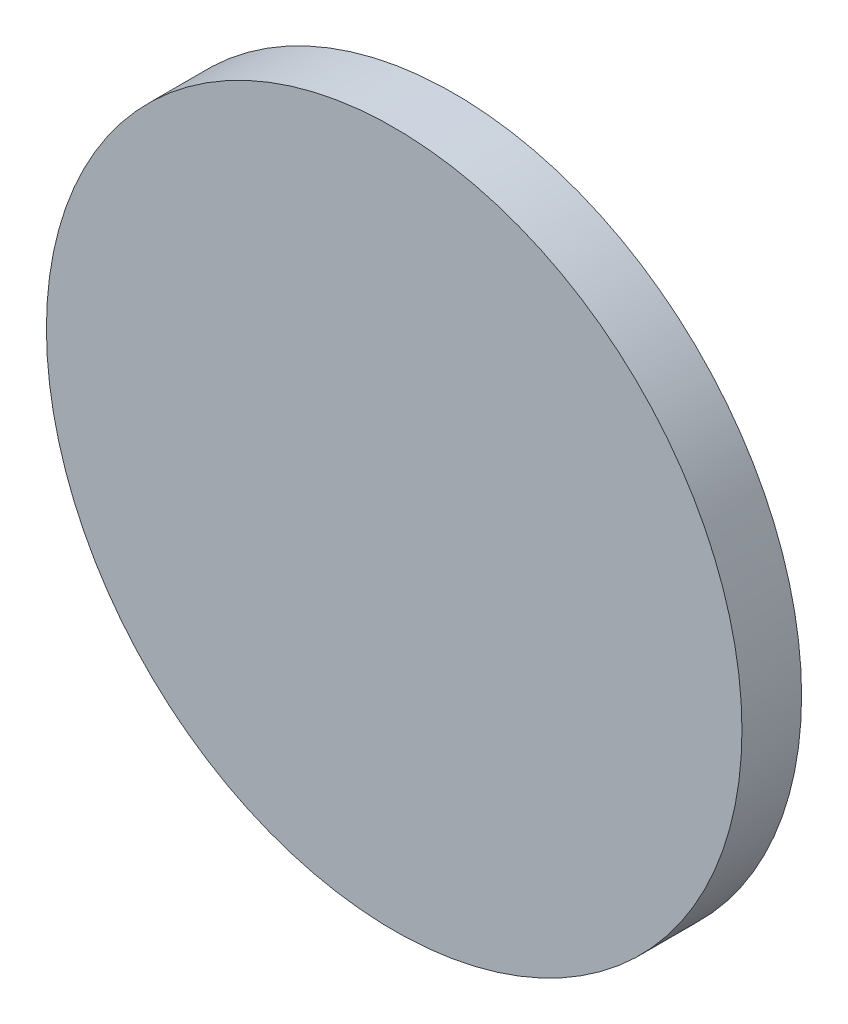
ISO-10303-21;
HEADER;
FILE_DESCRIPTION(('STEP AP214'),'2;1');
FILE_NAME('part.step','',(''),(''),'','','');
FILE_SCHEMA(('AUTOMOTIVE_DESIGN { 1 0 10303 214 1 1 1 1 }'));
ENDSEC;
DATA;
#1=APPLICATION_CONTEXT('core data for automotive mechanical design processes');
#2=APPLICATION_PROTOCOL_DEFINITION('international standard','automotive_design',2000,#1);
#3=PRODUCT_CONTEXT('',#1,'mechanical');
#4=PRODUCT('Part','Part','',(#3));
#5=PRODUCT_RELATED_PRODUCT_CATEGORY('part','',(#4));
#6=PRODUCT_DEFINITION_FORMATION('','',#4);
#7=PRODUCT_DEFINITION_CONTEXT('part definition',#1,'design');
#8=PRODUCT_DEFINITION('design','',#6,#7);
#9=PRODUCT_DEFINITION_SHAPE('','',#8);
#10=(LENGTH_UNIT() NAMED_UNIT(*) SI_UNIT(.MILLI.,.METRE.));
#11=(NAMED_UNIT(*) PLANE_ANGLE_UNIT() SI_UNIT($,.RADIAN.));
#12=(NAMED_UNIT(*) SI_UNIT($,.STERADIAN.) SOLID_ANGLE_UNIT());
#13=UNCERTAINTY_MEASURE_WITH_UNIT(LENGTH_MEASURE(1.E-05),#10,'distance_accuracy_value','');
#14=(GEOMETRIC_REPRESENTATION_CONTEXT(3) GLOBAL_UNCERTAINTY_ASSIGNED_CONTEXT((#13)) GLOBAL_UNIT_ASSIGNED_CONTEXT((#10,
#11,#12)) REPRESENTATION_CONTEXT('',''));
#15=CARTESIAN_POINT('',(0.,0.,0.));
#16=DIRECTION('',(0.,0.,1.));
#17=DIRECTION('',(1.,0.,0.));
#18=AXIS2_PLACEMENT_3D('',#15,#16,#17);
#19=CARTESIAN_POINT('',(9.21766,1.696720014875,0.));
#20=DIRECTION('',(0.,0.,-1.));
#21=DIRECTION('',(-1.,0.,0.));
#22=AXIS2_PLACEMENT_3D('',#19,#20,#21);
#23=PLANE('',#22);
#24=CARTESIAN_POINT('',(9.21766,1.696720014875,0.));
#25=DIRECTION('',(0.,0.,1.));
#26=DIRECTION('',(1.,0.,0.));
#27=AXIS2_PLACEMENT_3D('',#24,#25,#26);
#28=CIRCLE('',#27,0.200024667);
#29=CARTESIAN_POINT('',(9.417684667,1.696720014875,0.));
#30=VERTEX_POINT('',#29);
#31=EDGE_CURVE('E18',#30,#30,#28,.T.);
#32=ORIENTED_EDGE('',*,*,#31,.F.);
#33=EDGE_LOOP('',(#32));
#34=FACE_BOUND('',#33,.T.);
#35=ADVANCED_FACE('F15',(#34),#23,.T.);
#36=CARTESIAN_POINT('',(9.21766,1.696720014875,0.));
#37=DIRECTION('',(0.,0.,1.));
#38=DIRECTION('',(1.,0.,0.));
#39=AXIS2_PLACEMENT_3D('',#36,#37,#38);
#40=CYLINDRICAL_SURFACE('',#39,0.200024667);
#41=CARTESIAN_POINT('',(9.21766,1.696720014875,0.03429));
#42=DIRECTION('',(0.,0.,1.));
#43=DIRECTION('',(1.,0.,0.));
#44=AXIS2_PLACEMENT_3D('',#41,#42,#43);
#45=CIRCLE('',#44,0.200024667);
#46=CARTESIAN_POINT('',(9.417684667,1.696720014875,0.03429));
#47=VERTEX_POINT('',#46);
#48=EDGE_CURVE('E10',#47,#47,#45,.T.);
#49=ORIENTED_EDGE('',*,*,#48,.F.);
#50=EDGE_LOOP('',(#49));
#51=FACE_BOUND('',#50,.T.);
#52=ORIENTED_EDGE('',*,*,#31,.T.);
#53=EDGE_LOOP('',(#52));
#54=FACE_BOUND('',#53,.T.);
#55=ADVANCED_FACE('F27',(#51,#54),#40,.T.);
#56=CARTESIAN_POINT('',(9.21766,1.696720014875,0.03429));
#57=DIRECTION('',(0.,0.,1.));
#58=DIRECTION('',(1.,0.,0.));
#59=AXIS2_PLACEMENT_3D('',#56,#57,#58);
#60=PLANE('',#59);
#61=ORIENTED_EDGE('',*,*,#48,.T.);
#62=EDGE_LOOP('',(#61));
#63=FACE_BOUND('',#62,.T.);
#64=ADVANCED_FACE('F34',(#63),#60,.T.);
#65=CLOSED_SHELL('',(#35,#55,#64));
#66=MANIFOLD_SOLID_BREP('B1',#65);
#67=ADVANCED_BREP_SHAPE_REPRESENTATION('',(#18,#66),#14);
#68=SHAPE_DEFINITION_REPRESENTATION(#9,#67);
ENDSEC;
END-ISO-10303-21;
